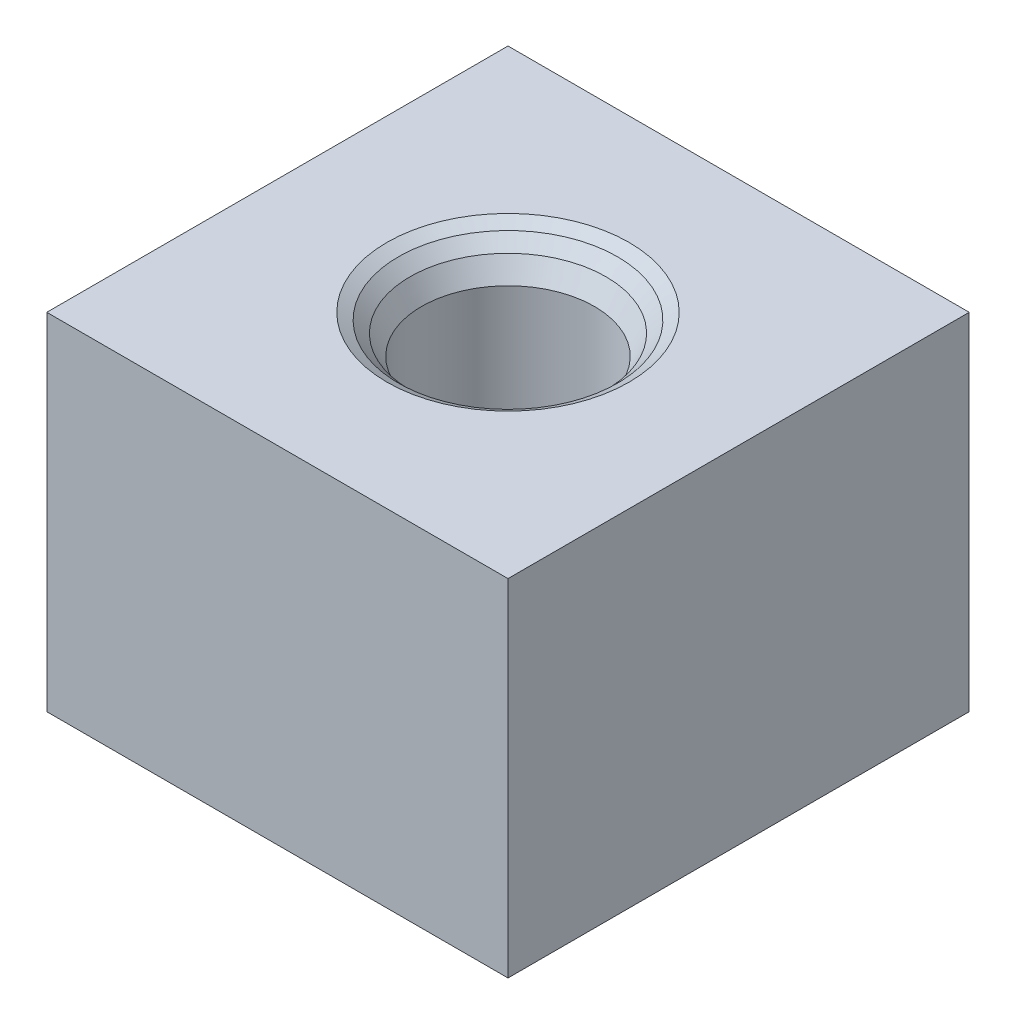
ISO-10303-21;
HEADER;
FILE_DESCRIPTION(('STEP AP214'),'2;1');
FILE_NAME('part.step','',(''),(''),'','','');
FILE_SCHEMA(('AUTOMOTIVE_DESIGN { 1 0 10303 214 1 1 1 1 }'));
ENDSEC;
DATA;
#1=APPLICATION_CONTEXT('core data for automotive mechanical design processes');
#2=APPLICATION_PROTOCOL_DEFINITION('international standard','automotive_design',2000,#1);
#3=PRODUCT_CONTEXT('',#1,'mechanical');
#4=PRODUCT('Part','Part','',(#3));
#5=PRODUCT_RELATED_PRODUCT_CATEGORY('part','',(#4));
#6=PRODUCT_DEFINITION_FORMATION('','',#4);
#7=PRODUCT_DEFINITION_CONTEXT('part definition',#1,'design');
#8=PRODUCT_DEFINITION('design','',#6,#7);
#9=PRODUCT_DEFINITION_SHAPE('','',#8);
#10=(LENGTH_UNIT() NAMED_UNIT(*) SI_UNIT(.MILLI.,.METRE.));
#11=(NAMED_UNIT(*) PLANE_ANGLE_UNIT() SI_UNIT($,.RADIAN.));
#12=(NAMED_UNIT(*) SI_UNIT($,.STERADIAN.) SOLID_ANGLE_UNIT());
#13=UNCERTAINTY_MEASURE_WITH_UNIT(LENGTH_MEASURE(1.E-05),#10,'distance_accuracy_value','');
#14=(GEOMETRIC_REPRESENTATION_CONTEXT(3) GLOBAL_UNCERTAINTY_ASSIGNED_CONTEXT((#13)) GLOBAL_UNIT_ASSIGNED_CONTEXT((#10,
#11,#12)) REPRESENTATION_CONTEXT('',''));
#15=CARTESIAN_POINT('',(0.,0.,0.));
#16=DIRECTION('',(0.,0.,1.));
#17=DIRECTION('',(1.,0.,0.));
#18=AXIS2_PLACEMENT_3D('',#15,#16,#17);
#19=CARTESIAN_POINT('',(40.,60.,40.));
#20=DIRECTION('',(-1.,0.,0.));
#21=DIRECTION('',(0.,0.,1.));
#22=AXIS2_PLACEMENT_3D('',#19,#20,#21);
#23=PLANE('',#22);
#24=DIRECTION('',(0.,0.,-1.));
#25=VECTOR('',#24,1.);
#26=CARTESIAN_POINT('',(40.,0.,40.));
#27=LINE('',#26,#25);
#28=CARTESIAN_POINT('',(40.,0.,40.));
#29=VERTEX_POINT('',#28);
#30=CARTESIAN_POINT('',(40.,0.,-40.));
#31=VERTEX_POINT('',#30);
#32=EDGE_CURVE('E96',#29,#31,#27,.T.);
#33=ORIENTED_EDGE('',*,*,#32,.T.);
#34=DIRECTION('',(0.,-1.,0.));
#35=VECTOR('',#34,1.);
#36=CARTESIAN_POINT('',(40.,60.,-40.));
#37=LINE('',#36,#35);
#38=CARTESIAN_POINT('',(40.,60.,-40.));
#39=VERTEX_POINT('',#38);
#40=EDGE_CURVE('E11',#39,#31,#37,.T.);
#41=ORIENTED_EDGE('',*,*,#40,.F.);
#42=DIRECTION('',(0.,0.,-1.));
#43=VECTOR('',#42,1.);
#44=CARTESIAN_POINT('',(40.,60.,40.));
#45=LINE('',#44,#43);
#46=CARTESIAN_POINT('',(40.,60.,40.));
#47=VERTEX_POINT('',#46);
#48=EDGE_CURVE('E84',#47,#39,#45,.T.);
#49=ORIENTED_EDGE('',*,*,#48,.F.);
#50=DIRECTION('',(0.,-1.,0.));
#51=VECTOR('',#50,1.);
#52=CARTESIAN_POINT('',(40.,60.,40.));
#53=LINE('',#52,#51);
#54=EDGE_CURVE('E92',#47,#29,#53,.T.);
#55=ORIENTED_EDGE('',*,*,#54,.T.);
#56=EDGE_LOOP('',(#33,#41,#49,#55));
#57=FACE_BOUND('',#56,.T.);
#58=ADVANCED_FACE('F33',(#57),#23,.F.);
#59=CARTESIAN_POINT('',(-40.,60.,-40.));
#60=DIRECTION('',(0.,0.,1.));
#61=DIRECTION('',(1.,0.,0.));
#62=AXIS2_PLACEMENT_3D('',#59,#60,#61);
#63=PLANE('',#62);
#64=DIRECTION('',(-1.,0.,0.));
#65=VECTOR('',#64,1.);
#66=CARTESIAN_POINT('',(-40.,0.,-40.));
#67=LINE('',#66,#65);
#68=CARTESIAN_POINT('',(-40.,0.,-40.));
#69=VERTEX_POINT('',#68);
#70=EDGE_CURVE('E88',#31,#69,#67,.T.);
#71=ORIENTED_EDGE('',*,*,#70,.T.);
#72=DIRECTION('',(0.,-1.,0.));
#73=VECTOR('',#72,1.);
#74=CARTESIAN_POINT('',(-40.,60.,-40.));
#75=LINE('',#74,#73);
#76=CARTESIAN_POINT('',(-40.,60.,-40.));
#77=VERTEX_POINT('',#76);
#78=EDGE_CURVE('E41',#77,#69,#75,.T.);
#79=ORIENTED_EDGE('',*,*,#78,.F.);
#80=DIRECTION('',(-1.,0.,0.));
#81=VECTOR('',#80,1.);
#82=CARTESIAN_POINT('',(-40.,60.,-40.));
#83=LINE('',#82,#81);
#84=EDGE_CURVE('E79',#39,#77,#83,.T.);
#85=ORIENTED_EDGE('',*,*,#84,.F.);
#86=ORIENTED_EDGE('',*,*,#40,.T.);
#87=EDGE_LOOP('',(#71,#79,#85,#86));
#88=FACE_BOUND('',#87,.T.);
#89=ADVANCED_FACE('F87',(#88),#63,.F.);
#90=CARTESIAN_POINT('',(-40.,60.,40.));
#91=DIRECTION('',(1.,0.,0.));
#92=DIRECTION('',(0.,0.,-1.));
#93=AXIS2_PLACEMENT_3D('',#90,#91,#92);
#94=PLANE('',#93);
#95=DIRECTION('',(0.,0.,1.));
#96=VECTOR('',#95,1.);
#97=CARTESIAN_POINT('',(-40.,0.,40.));
#98=LINE('',#97,#96);
#99=CARTESIAN_POINT('',(-40.,0.,40.));
#100=VERTEX_POINT('',#99);
#101=EDGE_CURVE('E66',#69,#100,#98,.T.);
#102=ORIENTED_EDGE('',*,*,#101,.T.);
#103=DIRECTION('',(0.,-1.,0.));
#104=VECTOR('',#103,1.);
#105=CARTESIAN_POINT('',(-40.,60.,40.));
#106=LINE('',#105,#104);
#107=CARTESIAN_POINT('',(-40.,60.,40.));
#108=VERTEX_POINT('',#107);
#109=EDGE_CURVE('E89',#108,#100,#106,.T.);
#110=ORIENTED_EDGE('',*,*,#109,.F.);
#111=DIRECTION('',(0.,0.,1.));
#112=VECTOR('',#111,1.);
#113=CARTESIAN_POINT('',(-40.,60.,40.));
#114=LINE('',#113,#112);
#115=EDGE_CURVE('E82',#77,#108,#114,.T.);
#116=ORIENTED_EDGE('',*,*,#115,.F.);
#117=ORIENTED_EDGE('',*,*,#78,.T.);
#118=EDGE_LOOP('',(#102,#110,#116,#117));
#119=FACE_BOUND('',#118,.T.);
#120=ADVANCED_FACE('F90',(#119),#94,.F.);
#121=CARTESIAN_POINT('',(-40.,60.,40.));
#122=DIRECTION('',(0.,0.,-1.));
#123=DIRECTION('',(-1.,0.,0.));
#124=AXIS2_PLACEMENT_3D('',#121,#122,#123);
#125=PLANE('',#124);
#126=DIRECTION('',(1.,0.,0.));
#127=VECTOR('',#126,1.);
#128=CARTESIAN_POINT('',(-40.,0.,40.));
#129=LINE('',#128,#127);
#130=EDGE_CURVE('E72',#100,#29,#129,.T.);
#131=ORIENTED_EDGE('',*,*,#130,.T.);
#132=ORIENTED_EDGE('',*,*,#54,.F.);
#133=DIRECTION('',(1.,0.,0.));
#134=VECTOR('',#133,1.);
#135=CARTESIAN_POINT('',(-40.,60.,40.));
#136=LINE('',#135,#134);
#137=EDGE_CURVE('E49',#108,#47,#136,.T.);
#138=ORIENTED_EDGE('',*,*,#137,.F.);
#139=ORIENTED_EDGE('',*,*,#109,.T.);
#140=EDGE_LOOP('',(#131,#132,#138,#139));
#141=FACE_BOUND('',#140,.T.);
#142=ADVANCED_FACE('F104',(#141),#125,.F.);
#143=CARTESIAN_POINT('',(0.,60.,0.));
#144=DIRECTION('',(0.,-1.,0.));
#145=DIRECTION('',(0.,0.,-1.));
#146=AXIS2_PLACEMENT_3D('',#143,#144,#145);
#147=PLANE('',#146);
#148=CARTESIAN_POINT('',(0.,60.,0.));
#149=DIRECTION('',(0.,-1.,0.));
#150=DIRECTION('',(0.,0.,-1.));
#151=AXIS2_PLACEMENT_3D('',#148,#149,#150);
#152=CIRCLE('',#151,21.);
#153=CARTESIAN_POINT('',(0.,60.,-21.));
#154=VERTEX_POINT('',#153);
#155=EDGE_CURVE('E99',#154,#154,#152,.T.);
#156=ORIENTED_EDGE('',*,*,#155,.T.);
#157=EDGE_LOOP('',(#156));
#158=FACE_BOUND('',#157,.T.);
#159=ORIENTED_EDGE('',*,*,#48,.T.);
#160=ORIENTED_EDGE('',*,*,#84,.T.);
#161=ORIENTED_EDGE('',*,*,#115,.T.);
#162=ORIENTED_EDGE('',*,*,#137,.T.);
#163=EDGE_LOOP('',(#159,#160,#161,#162));
#164=FACE_BOUND('',#163,.T.);
#165=ADVANCED_FACE('F80',(#158,#164),#147,.F.);
#166=CARTESIAN_POINT('',(0.,0.,0.));
#167=DIRECTION('',(0.,-1.,0.));
#168=DIRECTION('',(0.,0.,-1.));
#169=AXIS2_PLACEMENT_3D('',#166,#167,#168);
#170=PLANE('',#169);
#171=ORIENTED_EDGE('',*,*,#32,.F.);
#172=ORIENTED_EDGE('',*,*,#130,.F.);
#173=ORIENTED_EDGE('',*,*,#101,.F.);
#174=ORIENTED_EDGE('',*,*,#70,.F.);
#175=EDGE_LOOP('',(#171,#172,#173,#174));
#176=FACE_BOUND('',#175,.T.);
#177=ADVANCED_FACE('F107',(#176),#170,.T.);
#178=CARTESIAN_POINT('',(0.,60.,0.));
#179=DIRECTION('',(0.,1.,0.));
#180=DIRECTION('',(0.,0.,1.));
#181=AXIS2_PLACEMENT_3D('',#178,#179,#180);
#182=CONICAL_SURFACE('',#181,21.,1.0471975511966);
#183=CARTESIAN_POINT('',(0.,58.8452994616207,0.));
#184=DIRECTION('',(0.,-1.,0.));
#185=DIRECTION('',(0.,0.,-1.));
#186=AXIS2_PLACEMENT_3D('',#183,#184,#185);
#187=CIRCLE('',#186,19.);
#188=CARTESIAN_POINT('',(0.,58.8452994616207,-19.));
#189=VERTEX_POINT('',#188);
#190=EDGE_CURVE('E112',#189,#189,#187,.T.);
#191=ORIENTED_EDGE('',*,*,#190,.T.);
#192=EDGE_LOOP('',(#191));
#193=FACE_BOUND('',#192,.T.);
#194=ORIENTED_EDGE('',*,*,#155,.F.);
#195=EDGE_LOOP('',(#194));
#196=FACE_BOUND('',#195,.T.);
#197=ADVANCED_FACE('F149',(#193,#196),#182,.F.);
#198=CARTESIAN_POINT('',(0.,58.8452994616207,0.));
#199=DIRECTION('',(0.,1.,0.));
#200=DIRECTION('',(0.,0.,1.));
#201=AXIS2_PLACEMENT_3D('',#198,#199,#200);
#202=CONICAL_SURFACE('',#201,19.,0.785398163397442);
#203=CARTESIAN_POINT('',(0.,56.8452994616207,0.));
#204=DIRECTION('',(0.,-1.,0.));
#205=DIRECTION('',(0.,0.,-1.));
#206=AXIS2_PLACEMENT_3D('',#203,#204,#205);
#207=CIRCLE('',#206,17.);
#208=CARTESIAN_POINT('',(0.,56.8452994616207,-17.));
#209=VERTEX_POINT('',#208);
#210=EDGE_CURVE('E115',#209,#209,#207,.T.);
#211=ORIENTED_EDGE('',*,*,#210,.T.);
#212=EDGE_LOOP('',(#211));
#213=FACE_BOUND('',#212,.T.);
#214=ORIENTED_EDGE('',*,*,#190,.F.);
#215=EDGE_LOOP('',(#214));
#216=FACE_BOUND('',#215,.T.);
#217=ADVANCED_FACE('F155',(#213,#216),#202,.F.);
#218=CARTESIAN_POINT('',(0.,56.8452994616207,0.));
#219=DIRECTION('',(0.,1.,0.));
#220=DIRECTION('',(0.,0.,1.));
#221=AXIS2_PLACEMENT_3D('',#218,#219,#220);
#222=CONICAL_SURFACE('',#221,17.,0.523598775598292);
#223=CARTESIAN_POINT('',(0.,53.3811978464829,0.));
#224=DIRECTION('',(0.,-1.,0.));
#225=DIRECTION('',(0.,0.,-1.));
#226=AXIS2_PLACEMENT_3D('',#223,#224,#225);
#227=CIRCLE('',#226,15.);
#228=CARTESIAN_POINT('',(0.,53.3811978464829,-15.));
#229=VERTEX_POINT('',#228);
#230=EDGE_CURVE('E118',#229,#229,#227,.T.);
#231=ORIENTED_EDGE('',*,*,#230,.T.);
#232=EDGE_LOOP('',(#231));
#233=FACE_BOUND('',#232,.T.);
#234=ORIENTED_EDGE('',*,*,#210,.F.);
#235=EDGE_LOOP('',(#234));
#236=FACE_BOUND('',#235,.T.);
#237=ADVANCED_FACE('F134',(#233,#236),#222,.F.);
#238=CARTESIAN_POINT('',(0.,9.99999999999999,0.));
#239=DIRECTION('',(0.,-1.,0.));
#240=DIRECTION('',(0.,0.,-1.));
#241=AXIS2_PLACEMENT_3D('',#238,#239,#240);
#242=CYLINDRICAL_SURFACE('',#241,15.);
#243=CARTESIAN_POINT('',(0.,9.99999999999999,0.));
#244=DIRECTION('',(0.,-1.,0.));
#245=DIRECTION('',(0.,0.,-1.));
#246=AXIS2_PLACEMENT_3D('',#243,#244,#245);
#247=CIRCLE('',#246,15.);
#248=CARTESIAN_POINT('',(0.,9.99999999999999,-15.));
#249=VERTEX_POINT('',#248);
#250=EDGE_CURVE('E121',#249,#249,#247,.T.);
#251=ORIENTED_EDGE('',*,*,#250,.T.);
#252=EDGE_LOOP('',(#251));
#253=FACE_BOUND('',#252,.T.);
#254=ORIENTED_EDGE('',*,*,#230,.F.);
#255=EDGE_LOOP('',(#254));
#256=FACE_BOUND('',#255,.T.);
#257=ADVANCED_FACE('F125',(#253,#256),#242,.F.);
#258=CARTESIAN_POINT('',(-15.,9.99999999999999,0.));
#259=DIRECTION('',(0.,1.,0.));
#260=DIRECTION('',(0.,0.,1.));
#261=AXIS2_PLACEMENT_3D('',#258,#259,#260);
#262=PLANE('',#261);
#263=ORIENTED_EDGE('',*,*,#250,.F.);
#264=EDGE_LOOP('',(#263));
#265=FACE_BOUND('',#264,.T.);
#266=ADVANCED_FACE('F128',(#265),#262,.T.);
#267=CLOSED_SHELL('',(#58,#89,#120,#142,#165,#177,#197,#217,#237,#257,#266));
#268=MANIFOLD_SOLID_BREP('B2',#267);
#269=ADVANCED_BREP_SHAPE_REPRESENTATION('',(#18,#268),#14);
#270=SHAPE_DEFINITION_REPRESENTATION(#9,#269);
ENDSEC;
END-ISO-10303-21;
